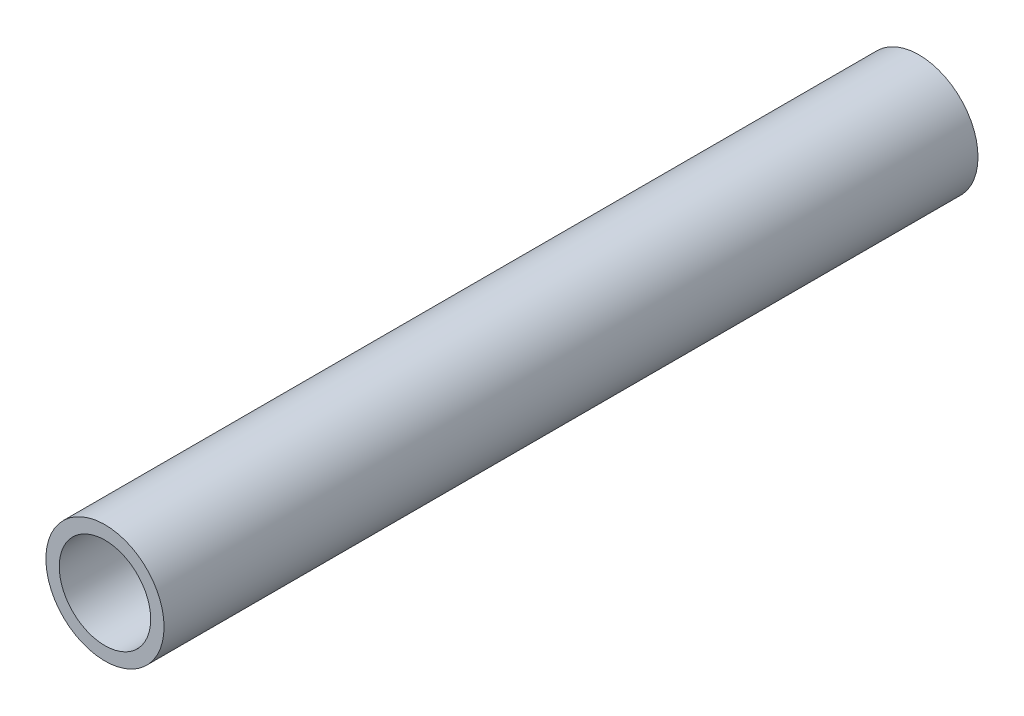
ISO-10303-21;
HEADER;
FILE_DESCRIPTION(('STEP AP214'),'2;1');
FILE_NAME('part.step','',(''),(''),'','','');
FILE_SCHEMA(('AUTOMOTIVE_DESIGN { 1 0 10303 214 1 1 1 1 }'));
ENDSEC;
DATA;
#1=APPLICATION_CONTEXT('core data for automotive mechanical design processes');
#2=APPLICATION_PROTOCOL_DEFINITION('international standard','automotive_design',2000,#1);
#3=PRODUCT_CONTEXT('',#1,'mechanical');
#4=PRODUCT('Part','Part','',(#3));
#5=PRODUCT_RELATED_PRODUCT_CATEGORY('part','',(#4));
#6=PRODUCT_DEFINITION_FORMATION('','',#4);
#7=PRODUCT_DEFINITION_CONTEXT('part definition',#1,'design');
#8=PRODUCT_DEFINITION('design','',#6,#7);
#9=PRODUCT_DEFINITION_SHAPE('','',#8);
#10=(LENGTH_UNIT() NAMED_UNIT(*) SI_UNIT(.MILLI.,.METRE.));
#11=(NAMED_UNIT(*) PLANE_ANGLE_UNIT() SI_UNIT($,.RADIAN.));
#12=(NAMED_UNIT(*) SI_UNIT($,.STERADIAN.) SOLID_ANGLE_UNIT());
#13=UNCERTAINTY_MEASURE_WITH_UNIT(LENGTH_MEASURE(1.E-05),#10,'distance_accuracy_value','');
#14=(GEOMETRIC_REPRESENTATION_CONTEXT(3) GLOBAL_UNCERTAINTY_ASSIGNED_CONTEXT((#13)) GLOBAL_UNIT_ASSIGNED_CONTEXT((#10,
#11,#12)) REPRESENTATION_CONTEXT('',''));
#15=CARTESIAN_POINT('',(0.,0.,0.));
#16=DIRECTION('',(0.,0.,1.));
#17=DIRECTION('',(1.,0.,0.));
#18=AXIS2_PLACEMENT_3D('',#15,#16,#17);
#19=CARTESIAN_POINT('',(0.,0.,60.96));
#20=DIRECTION('',(0.,0.,1.));
#21=DIRECTION('',(1.,0.,0.));
#22=AXIS2_PLACEMENT_3D('',#19,#20,#21);
#23=PLANE('',#22);
#24=CARTESIAN_POINT('',(0.,0.,60.96));
#25=DIRECTION('',(0.,0.,1.));
#26=DIRECTION('',(1.,0.,0.));
#27=AXIS2_PLACEMENT_3D('',#24,#25,#26);
#28=CIRCLE('',#27,4.425);
#29=CARTESIAN_POINT('',(4.425,0.,60.96));
#30=VERTEX_POINT('',#29);
#31=EDGE_CURVE('E10',#30,#30,#28,.T.);
#32=ORIENTED_EDGE('',*,*,#31,.T.);
#33=EDGE_LOOP('',(#32));
#34=FACE_BOUND('',#33,.T.);
#35=CARTESIAN_POINT('',(0.,0.,60.96));
#36=DIRECTION('',(0.,0.,1.));
#37=DIRECTION('',(1.,0.,0.));
#38=AXIS2_PLACEMENT_3D('',#35,#36,#37);
#39=CIRCLE('',#38,3.425);
#40=CARTESIAN_POINT('',(3.425,0.,60.96));
#41=VERTEX_POINT('',#40);
#42=EDGE_CURVE('E50',#41,#41,#39,.T.);
#43=ORIENTED_EDGE('',*,*,#42,.F.);
#44=EDGE_LOOP('',(#43));
#45=FACE_BOUND('',#44,.T.);
#46=ADVANCED_FACE('F37',(#34,#45),#23,.T.);
#47=CARTESIAN_POINT('',(0.,0.,0.));
#48=DIRECTION('',(0.,0.,1.));
#49=DIRECTION('',(1.,0.,0.));
#50=AXIS2_PLACEMENT_3D('',#47,#48,#49);
#51=PLANE('',#50);
#52=CARTESIAN_POINT('',(0.,0.,0.));
#53=DIRECTION('',(0.,0.,1.));
#54=DIRECTION('',(1.,0.,0.));
#55=AXIS2_PLACEMENT_3D('',#52,#53,#54);
#56=CIRCLE('',#55,4.425);
#57=CARTESIAN_POINT('',(4.425,0.,0.));
#58=VERTEX_POINT('',#57);
#59=EDGE_CURVE('E41',#58,#58,#56,.T.);
#60=ORIENTED_EDGE('',*,*,#59,.F.);
#61=EDGE_LOOP('',(#60));
#62=FACE_BOUND('',#61,.T.);
#63=CARTESIAN_POINT('',(0.,0.,0.));
#64=DIRECTION('',(0.,0.,1.));
#65=DIRECTION('',(1.,0.,0.));
#66=AXIS2_PLACEMENT_3D('',#63,#64,#65);
#67=CIRCLE('',#66,3.425);
#68=CARTESIAN_POINT('',(3.425,0.,0.));
#69=VERTEX_POINT('',#68);
#70=EDGE_CURVE('E52',#69,#69,#67,.T.);
#71=ORIENTED_EDGE('',*,*,#70,.T.);
#72=EDGE_LOOP('',(#71));
#73=FACE_BOUND('',#72,.T.);
#74=ADVANCED_FACE('F64',(#62,#73),#51,.F.);
#75=CARTESIAN_POINT('',(0.,0.,60.96));
#76=DIRECTION('',(0.,0.,-1.));
#77=DIRECTION('',(-1.,0.,0.));
#78=AXIS2_PLACEMENT_3D('',#75,#76,#77);
#79=CYLINDRICAL_SURFACE('',#78,4.425);
#80=ORIENTED_EDGE('',*,*,#31,.F.);
#81=EDGE_LOOP('',(#80));
#82=FACE_BOUND('',#81,.T.);
#83=ORIENTED_EDGE('',*,*,#59,.T.);
#84=EDGE_LOOP('',(#83));
#85=FACE_BOUND('',#84,.T.);
#86=ADVANCED_FACE('F39',(#82,#85),#79,.T.);
#87=CARTESIAN_POINT('',(0.,0.,60.96));
#88=DIRECTION('',(0.,0.,-1.));
#89=DIRECTION('',(-1.,0.,0.));
#90=AXIS2_PLACEMENT_3D('',#87,#88,#89);
#91=CYLINDRICAL_SURFACE('',#90,3.425);
#92=ORIENTED_EDGE('',*,*,#42,.T.);
#93=EDGE_LOOP('',(#92));
#94=FACE_BOUND('',#93,.T.);
#95=ORIENTED_EDGE('',*,*,#70,.F.);
#96=EDGE_LOOP('',(#95));
#97=FACE_BOUND('',#96,.T.);
#98=ADVANCED_FACE('F60',(#94,#97),#91,.F.);
#99=CLOSED_SHELL('',(#46,#74,#86,#98));
#100=MANIFOLD_SOLID_BREP('B2',#99);
#101=ADVANCED_BREP_SHAPE_REPRESENTATION('',(#18,#100),#14);
#102=SHAPE_DEFINITION_REPRESENTATION(#9,#101);
ENDSEC;
END-ISO-10303-21;
